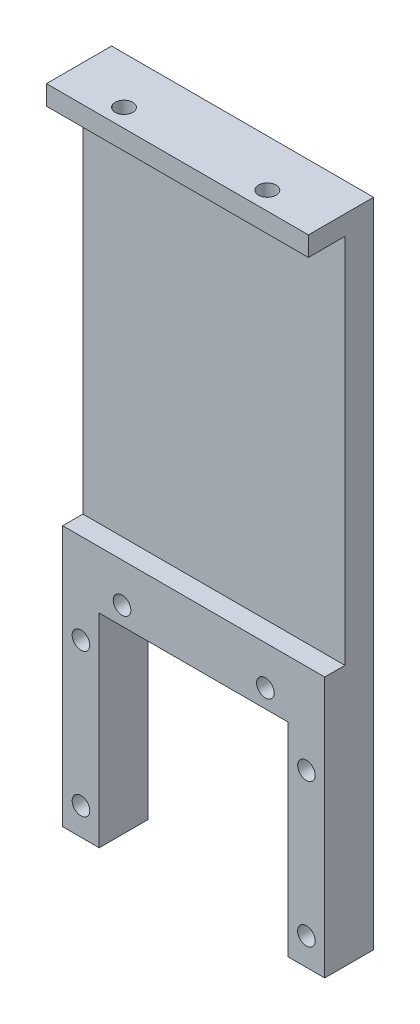
ISO-10303-21;
HEADER;
FILE_DESCRIPTION(('STEP AP214'),'2;1');
FILE_NAME('part.step','',(''),(''),'','','');
FILE_SCHEMA(('AUTOMOTIVE_DESIGN { 1 0 10303 214 1 1 1 1 }'));
ENDSEC;
DATA;
#1=APPLICATION_CONTEXT('core data for automotive mechanical design processes');
#2=APPLICATION_PROTOCOL_DEFINITION('international standard','automotive_design',2000,#1);
#3=PRODUCT_CONTEXT('',#1,'mechanical');
#4=PRODUCT('Part','Part','',(#3));
#5=PRODUCT_RELATED_PRODUCT_CATEGORY('part','',(#4));
#6=PRODUCT_DEFINITION_FORMATION('','',#4);
#7=PRODUCT_DEFINITION_CONTEXT('part definition',#1,'design');
#8=PRODUCT_DEFINITION('design','',#6,#7);
#9=PRODUCT_DEFINITION_SHAPE('','',#8);
#10=(LENGTH_UNIT() NAMED_UNIT(*) SI_UNIT(.MILLI.,.METRE.));
#11=(NAMED_UNIT(*) PLANE_ANGLE_UNIT() SI_UNIT($,.RADIAN.));
#12=(NAMED_UNIT(*) SI_UNIT($,.STERADIAN.) SOLID_ANGLE_UNIT());
#13=UNCERTAINTY_MEASURE_WITH_UNIT(LENGTH_MEASURE(1.E-05),#10,'distance_accuracy_value','');
#14=(GEOMETRIC_REPRESENTATION_CONTEXT(3) GLOBAL_UNCERTAINTY_ASSIGNED_CONTEXT((#13)) GLOBAL_UNIT_ASSIGNED_CONTEXT((#10,
#11,#12)) REPRESENTATION_CONTEXT('',''));
#15=CARTESIAN_POINT('',(0.,0.,0.));
#16=DIRECTION('',(0.,0.,1.));
#17=DIRECTION('',(1.,0.,0.));
#18=AXIS2_PLACEMENT_3D('',#15,#16,#17);
#19=CARTESIAN_POINT('',(-20.1,-50.,10.));
#20=DIRECTION('',(0.,1.,0.));
#21=DIRECTION('',(0.,0.,1.));
#22=AXIS2_PLACEMENT_3D('',#19,#20,#21);
#23=PLANE('',#22);
#24=DIRECTION('',(1.,0.,0.));
#25=VECTOR('',#24,1.);
#26=CARTESIAN_POINT('',(-20.1,-50.,7.5));
#27=LINE('',#26,#25);
#28=CARTESIAN_POINT('',(14.5,-50.,7.5));
#29=VERTEX_POINT('',#28);
#30=CARTESIAN_POINT('',(20.1,-50.,7.5));
#31=VERTEX_POINT('',#30);
#32=EDGE_CURVE('E187',#29,#31,#27,.T.);
#33=ORIENTED_EDGE('',*,*,#32,.F.);
#34=DIRECTION('',(0.,0.,1.));
#35=VECTOR('',#34,1.);
#36=CARTESIAN_POINT('',(14.5,-50.,0.));
#37=LINE('',#36,#35);
#38=CARTESIAN_POINT('',(14.5,-50.,0.));
#39=VERTEX_POINT('',#38);
#40=EDGE_CURVE('E154',#39,#29,#37,.T.);
#41=ORIENTED_EDGE('',*,*,#40,.F.);
#42=DIRECTION('',(1.,0.,0.));
#43=VECTOR('',#42,1.);
#44=CARTESIAN_POINT('',(-20.1,-50.,0.));
#45=LINE('',#44,#43);
#46=CARTESIAN_POINT('',(20.1,-50.,0.));
#47=VERTEX_POINT('',#46);
#48=EDGE_CURVE('E144',#39,#47,#45,.T.);
#49=ORIENTED_EDGE('',*,*,#48,.T.);
#50=DIRECTION('',(0.,0.,-1.));
#51=VECTOR('',#50,1.);
#52=CARTESIAN_POINT('',(20.1,-50.,10.));
#53=LINE('',#52,#51);
#54=EDGE_CURVE('E200',#31,#47,#53,.T.);
#55=ORIENTED_EDGE('',*,*,#54,.F.);
#56=EDGE_LOOP('',(#33,#41,#49,#55));
#57=FACE_BOUND('',#56,.T.);
#58=ADVANCED_FACE('F35',(#57),#23,.F.);
#59=CARTESIAN_POINT('',(20.1,-50.,10.));
#60=DIRECTION('',(-1.,0.,0.));
#61=DIRECTION('',(0.,0.,1.));
#62=AXIS2_PLACEMENT_3D('',#59,#60,#61);
#63=PLANE('',#62);
#64=DIRECTION('',(0.,1.,0.));
#65=VECTOR('',#64,1.);
#66=CARTESIAN_POINT('',(20.1,47.,4.4));
#67=LINE('',#66,#65);
#68=CARTESIAN_POINT('',(20.1,-10.,4.4));
#69=VERTEX_POINT('',#68);
#70=CARTESIAN_POINT('',(20.1,47.,4.4));
#71=VERTEX_POINT('',#70);
#72=EDGE_CURVE('E161',#69,#71,#67,.T.);
#73=ORIENTED_EDGE('',*,*,#72,.F.);
#74=DIRECTION('',(0.,0.,1.));
#75=VECTOR('',#74,1.);
#76=CARTESIAN_POINT('',(20.1,-10.,4.4));
#77=LINE('',#76,#75);
#78=CARTESIAN_POINT('',(20.1,-10.,7.5));
#79=VERTEX_POINT('',#78);
#80=EDGE_CURVE('E174',#69,#79,#77,.T.);
#81=ORIENTED_EDGE('',*,*,#80,.T.);
#82=DIRECTION('',(0.,1.,0.));
#83=VECTOR('',#82,1.);
#84=CARTESIAN_POINT('',(20.1,-50.,7.5));
#85=LINE('',#84,#83);
#86=EDGE_CURVE('E177',#31,#79,#85,.T.);
#87=ORIENTED_EDGE('',*,*,#86,.F.);
#88=ORIENTED_EDGE('',*,*,#54,.T.);
#89=DIRECTION('',(0.,1.,0.));
#90=VECTOR('',#89,1.);
#91=CARTESIAN_POINT('',(20.1,-50.,0.));
#92=LINE('',#91,#90);
#93=CARTESIAN_POINT('',(20.1,50.,0.));
#94=VERTEX_POINT('',#93);
#95=EDGE_CURVE('E191',#47,#94,#92,.T.);
#96=ORIENTED_EDGE('',*,*,#95,.T.);
#97=DIRECTION('',(0.,0.,-1.));
#98=VECTOR('',#97,1.);
#99=CARTESIAN_POINT('',(20.1,50.,10.));
#100=LINE('',#99,#98);
#101=CARTESIAN_POINT('',(20.1,50.,10.));
#102=VERTEX_POINT('',#101);
#103=EDGE_CURVE('E217',#102,#94,#100,.T.);
#104=ORIENTED_EDGE('',*,*,#103,.F.);
#105=DIRECTION('',(0.,1.,0.));
#106=VECTOR('',#105,1.);
#107=CARTESIAN_POINT('',(20.1,-50.,10.));
#108=LINE('',#107,#106);
#109=CARTESIAN_POINT('',(20.1,47.,10.));
#110=VERTEX_POINT('',#109);
#111=EDGE_CURVE('E192',#110,#102,#108,.T.);
#112=ORIENTED_EDGE('',*,*,#111,.F.);
#113=DIRECTION('',(0.,0.,1.));
#114=VECTOR('',#113,1.);
#115=CARTESIAN_POINT('',(20.1,47.,4.4));
#116=LINE('',#115,#114);
#117=EDGE_CURVE('E172',#71,#110,#116,.T.);
#118=ORIENTED_EDGE('',*,*,#117,.F.);
#119=EDGE_LOOP('',(#73,#81,#87,#88,#96,#104,#112,#118));
#120=FACE_BOUND('',#119,.T.);
#121=ADVANCED_FACE('F37',(#120),#63,.F.);
#122=CARTESIAN_POINT('',(-20.1,50.,10.));
#123=DIRECTION('',(0.,-1.,0.));
#124=DIRECTION('',(0.,0.,-1.));
#125=AXIS2_PLACEMENT_3D('',#122,#123,#124);
#126=PLANE('',#125);
#127=CARTESIAN_POINT('',(-11.,50.,7.2));
#128=DIRECTION('',(0.,1.,0.));
#129=DIRECTION('',(0.,0.,1.));
#130=AXIS2_PLACEMENT_3D('',#127,#128,#129);
#131=CIRCLE('',#130,1.35);
#132=CARTESIAN_POINT('',(-11.,50.,8.55));
#133=VERTEX_POINT('',#132);
#134=EDGE_CURVE('E330',#133,#133,#131,.T.);
#135=ORIENTED_EDGE('',*,*,#134,.F.);
#136=EDGE_LOOP('',(#135));
#137=FACE_BOUND('',#136,.T.);
#138=CARTESIAN_POINT('',(11.,50.,7.2));
#139=DIRECTION('',(0.,1.,0.));
#140=DIRECTION('',(0.,0.,1.));
#141=AXIS2_PLACEMENT_3D('',#138,#139,#140);
#142=CIRCLE('',#141,1.35);
#143=CARTESIAN_POINT('',(11.,50.,8.55));
#144=VERTEX_POINT('',#143);
#145=EDGE_CURVE('E333',#144,#144,#142,.T.);
#146=ORIENTED_EDGE('',*,*,#145,.F.);
#147=EDGE_LOOP('',(#146));
#148=FACE_BOUND('',#147,.T.);
#149=DIRECTION('',(-1.,0.,0.));
#150=VECTOR('',#149,1.);
#151=CARTESIAN_POINT('',(-20.1,50.,0.));
#152=LINE('',#151,#150);
#153=CARTESIAN_POINT('',(-20.1,50.,0.));
#154=VERTEX_POINT('',#153);
#155=EDGE_CURVE('E203',#94,#154,#152,.T.);
#156=ORIENTED_EDGE('',*,*,#155,.T.);
#157=DIRECTION('',(0.,0.,-1.));
#158=VECTOR('',#157,1.);
#159=CARTESIAN_POINT('',(-20.1,50.,10.));
#160=LINE('',#159,#158);
#161=CARTESIAN_POINT('',(-20.1,50.,10.));
#162=VERTEX_POINT('',#161);
#163=EDGE_CURVE('E214',#162,#154,#160,.T.);
#164=ORIENTED_EDGE('',*,*,#163,.F.);
#165=DIRECTION('',(-1.,0.,0.));
#166=VECTOR('',#165,1.);
#167=CARTESIAN_POINT('',(-20.1,50.,10.));
#168=LINE('',#167,#166);
#169=EDGE_CURVE('E194',#102,#162,#168,.T.);
#170=ORIENTED_EDGE('',*,*,#169,.F.);
#171=ORIENTED_EDGE('',*,*,#103,.T.);
#172=EDGE_LOOP('',(#156,#164,#170,#171));
#173=FACE_BOUND('',#172,.T.);
#174=ADVANCED_FACE('F292',(#137,#148,#173),#126,.F.);
#175=CARTESIAN_POINT('',(-20.1,-50.,10.));
#176=DIRECTION('',(1.,0.,0.));
#177=DIRECTION('',(0.,0.,-1.));
#178=AXIS2_PLACEMENT_3D('',#175,#176,#177);
#179=PLANE('',#178);
#180=DIRECTION('',(0.,-1.,0.));
#181=VECTOR('',#180,1.);
#182=CARTESIAN_POINT('',(-20.1,-50.,7.5));
#183=LINE('',#182,#181);
#184=CARTESIAN_POINT('',(-20.1,-10.,7.5));
#185=VERTEX_POINT('',#184);
#186=CARTESIAN_POINT('',(-20.1,-50.,7.5));
#187=VERTEX_POINT('',#186);
#188=EDGE_CURVE('E185',#185,#187,#183,.T.);
#189=ORIENTED_EDGE('',*,*,#188,.F.);
#190=DIRECTION('',(0.,0.,1.));
#191=VECTOR('',#190,1.);
#192=CARTESIAN_POINT('',(-20.1,-10.,4.4));
#193=LINE('',#192,#191);
#194=CARTESIAN_POINT('',(-20.1,-10.,4.4));
#195=VERTEX_POINT('',#194);
#196=EDGE_CURVE('E60',#195,#185,#193,.T.);
#197=ORIENTED_EDGE('',*,*,#196,.F.);
#198=DIRECTION('',(0.,-1.,0.));
#199=VECTOR('',#198,1.);
#200=CARTESIAN_POINT('',(-20.1,47.,4.4));
#201=LINE('',#200,#199);
#202=CARTESIAN_POINT('',(-20.1,47.,4.4));
#203=VERTEX_POINT('',#202);
#204=EDGE_CURVE('E167',#203,#195,#201,.T.);
#205=ORIENTED_EDGE('',*,*,#204,.F.);
#206=DIRECTION('',(0.,0.,1.));
#207=VECTOR('',#206,1.);
#208=CARTESIAN_POINT('',(-20.1,47.,4.4));
#209=LINE('',#208,#207);
#210=CARTESIAN_POINT('',(-20.1,47.,10.));
#211=VERTEX_POINT('',#210);
#212=EDGE_CURVE('E179',#203,#211,#209,.T.);
#213=ORIENTED_EDGE('',*,*,#212,.T.);
#214=DIRECTION('',(0.,-1.,0.));
#215=VECTOR('',#214,1.);
#216=CARTESIAN_POINT('',(-20.1,-50.,10.));
#217=LINE('',#216,#215);
#218=EDGE_CURVE('E197',#162,#211,#217,.T.);
#219=ORIENTED_EDGE('',*,*,#218,.F.);
#220=ORIENTED_EDGE('',*,*,#163,.T.);
#221=DIRECTION('',(0.,-1.,0.));
#222=VECTOR('',#221,1.);
#223=CARTESIAN_POINT('',(-20.1,-50.,0.));
#224=LINE('',#223,#222);
#225=CARTESIAN_POINT('',(-20.1,-50.,0.));
#226=VERTEX_POINT('',#225);
#227=EDGE_CURVE('E205',#154,#226,#224,.T.);
#228=ORIENTED_EDGE('',*,*,#227,.T.);
#229=DIRECTION('',(0.,0.,-1.));
#230=VECTOR('',#229,1.);
#231=CARTESIAN_POINT('',(-20.1,-50.,10.));
#232=LINE('',#231,#230);
#233=EDGE_CURVE('E212',#187,#226,#232,.T.);
#234=ORIENTED_EDGE('',*,*,#233,.F.);
#235=EDGE_LOOP('',(#189,#197,#205,#213,#219,#220,#228,#234));
#236=FACE_BOUND('',#235,.T.);
#237=ADVANCED_FACE('F286',(#236),#179,.F.);
#238=CARTESIAN_POINT('',(-14.5,-50.,0.));
#239=VERTEX_POINT('',#238);
#240=EDGE_CURVE('E195',#226,#239,#45,.T.);
#241=ORIENTED_EDGE('',*,*,#240,.T.);
#242=DIRECTION('',(0.,0.,1.));
#243=VECTOR('',#242,1.);
#244=CARTESIAN_POINT('',(-14.5,-50.,0.));
#245=LINE('',#244,#243);
#246=CARTESIAN_POINT('',(-14.5,-50.,7.5));
#247=VERTEX_POINT('',#246);
#248=EDGE_CURVE('E157',#239,#247,#245,.T.);
#249=ORIENTED_EDGE('',*,*,#248,.T.);
#250=EDGE_CURVE('E188',#187,#247,#27,.T.);
#251=ORIENTED_EDGE('',*,*,#250,.F.);
#252=ORIENTED_EDGE('',*,*,#233,.T.);
#253=EDGE_LOOP('',(#241,#249,#251,#252));
#254=FACE_BOUND('',#253,.T.);
#255=ADVANCED_FACE('F281',(#254),#23,.F.);
#256=CARTESIAN_POINT('',(20.1,50.,10.));
#257=DIRECTION('',(0.,0.,-1.));
#258=DIRECTION('',(-1.,0.,0.));
#259=AXIS2_PLACEMENT_3D('',#256,#257,#258);
#260=PLANE('',#259);
#261=ORIENTED_EDGE('',*,*,#218,.T.);
#262=DIRECTION('',(-1.,0.,0.));
#263=VECTOR('',#262,1.);
#264=CARTESIAN_POINT('',(-20.1,47.,10.));
#265=LINE('',#264,#263);
#266=EDGE_CURVE('E156',#110,#211,#265,.T.);
#267=ORIENTED_EDGE('',*,*,#266,.F.);
#268=ORIENTED_EDGE('',*,*,#111,.T.);
#269=ORIENTED_EDGE('',*,*,#169,.T.);
#270=EDGE_LOOP('',(#261,#267,#268,#269));
#271=FACE_BOUND('',#270,.T.);
#272=ADVANCED_FACE('F307',(#271),#260,.F.);
#273=CARTESIAN_POINT('',(20.1,50.,0.));
#274=DIRECTION('',(0.,0.,-1.));
#275=DIRECTION('',(-1.,0.,0.));
#276=AXIS2_PLACEMENT_3D('',#273,#274,#275);
#277=PLANE('',#276);
#278=CARTESIAN_POINT('',(17.3,-45.8,0.));
#279=DIRECTION('',(0.,0.,1.));
#280=DIRECTION('',(1.,0.,0.));
#281=AXIS2_PLACEMENT_3D('',#278,#279,#280);
#282=CIRCLE('',#281,1.35);
#283=CARTESIAN_POINT('',(18.65,-45.8,0.));
#284=VERTEX_POINT('',#283);
#285=EDGE_CURVE('E249',#284,#284,#282,.T.);
#286=ORIENTED_EDGE('',*,*,#285,.T.);
#287=EDGE_LOOP('',(#286));
#288=FACE_BOUND('',#287,.T.);
#289=CARTESIAN_POINT('',(-17.3,-45.8,0.));
#290=DIRECTION('',(0.,0.,1.));
#291=DIRECTION('',(1.,0.,0.));
#292=AXIS2_PLACEMENT_3D('',#289,#290,#291);
#293=CIRCLE('',#292,1.35);
#294=CARTESIAN_POINT('',(-15.95,-45.8,0.));
#295=VERTEX_POINT('',#294);
#296=EDGE_CURVE('E239',#295,#295,#293,.T.);
#297=ORIENTED_EDGE('',*,*,#296,.T.);
#298=EDGE_LOOP('',(#297));
#299=FACE_BOUND('',#298,.T.);
#300=CARTESIAN_POINT('',(-11.,-16.,0.));
#301=DIRECTION('',(0.,0.,1.));
#302=DIRECTION('',(1.,0.,0.));
#303=AXIS2_PLACEMENT_3D('',#300,#301,#302);
#304=CIRCLE('',#303,1.35);
#305=CARTESIAN_POINT('',(-9.65,-16.,0.));
#306=VERTEX_POINT('',#305);
#307=EDGE_CURVE('E236',#306,#306,#304,.T.);
#308=ORIENTED_EDGE('',*,*,#307,.T.);
#309=EDGE_LOOP('',(#308));
#310=FACE_BOUND('',#309,.T.);
#311=CARTESIAN_POINT('',(-17.3,-23.8,0.));
#312=DIRECTION('',(0.,0.,1.));
#313=DIRECTION('',(1.,0.,0.));
#314=AXIS2_PLACEMENT_3D('',#311,#312,#313);
#315=CIRCLE('',#314,1.35000000000001);
#316=CARTESIAN_POINT('',(-15.95,-23.8,0.));
#317=VERTEX_POINT('',#316);
#318=EDGE_CURVE('E233',#317,#317,#315,.T.);
#319=ORIENTED_EDGE('',*,*,#318,.T.);
#320=EDGE_LOOP('',(#319));
#321=FACE_BOUND('',#320,.T.);
#322=CARTESIAN_POINT('',(11.,-16.,0.));
#323=DIRECTION('',(0.,0.,1.));
#324=DIRECTION('',(1.,0.,0.));
#325=AXIS2_PLACEMENT_3D('',#322,#323,#324);
#326=CIRCLE('',#325,1.35);
#327=CARTESIAN_POINT('',(12.35,-16.,0.));
#328=VERTEX_POINT('',#327);
#329=EDGE_CURVE('E229',#328,#328,#326,.T.);
#330=ORIENTED_EDGE('',*,*,#329,.T.);
#331=EDGE_LOOP('',(#330));
#332=FACE_BOUND('',#331,.T.);
#333=CARTESIAN_POINT('',(17.3,-23.8,0.));
#334=DIRECTION('',(0.,0.,1.));
#335=DIRECTION('',(1.,0.,0.));
#336=AXIS2_PLACEMENT_3D('',#333,#334,#335);
#337=CIRCLE('',#336,1.35000000000001);
#338=CARTESIAN_POINT('',(18.65,-23.8,0.));
#339=VERTEX_POINT('',#338);
#340=EDGE_CURVE('E148',#339,#339,#337,.T.);
#341=ORIENTED_EDGE('',*,*,#340,.T.);
#342=EDGE_LOOP('',(#341));
#343=FACE_BOUND('',#342,.T.);
#344=DIRECTION('',(0.,1.,0.));
#345=VECTOR('',#344,1.);
#346=CARTESIAN_POINT('',(14.5,-18.8,0.));
#347=LINE('',#346,#345);
#348=CARTESIAN_POINT('',(14.5,-18.8,0.));
#349=VERTEX_POINT('',#348);
#350=EDGE_CURVE('E127',#39,#349,#347,.T.);
#351=ORIENTED_EDGE('',*,*,#350,.T.);
#352=DIRECTION('',(-1.,0.,0.));
#353=VECTOR('',#352,1.);
#354=CARTESIAN_POINT('',(-14.5,-18.8,0.));
#355=LINE('',#354,#353);
#356=CARTESIAN_POINT('',(-14.5,-18.8,0.));
#357=VERTEX_POINT('',#356);
#358=EDGE_CURVE('E134',#349,#357,#355,.T.);
#359=ORIENTED_EDGE('',*,*,#358,.T.);
#360=DIRECTION('',(0.,-1.,0.));
#361=VECTOR('',#360,1.);
#362=CARTESIAN_POINT('',(-14.5,-18.8,0.));
#363=LINE('',#362,#361);
#364=EDGE_CURVE('E131',#357,#239,#363,.T.);
#365=ORIENTED_EDGE('',*,*,#364,.T.);
#366=ORIENTED_EDGE('',*,*,#240,.F.);
#367=ORIENTED_EDGE('',*,*,#227,.F.);
#368=ORIENTED_EDGE('',*,*,#155,.F.);
#369=ORIENTED_EDGE('',*,*,#95,.F.);
#370=ORIENTED_EDGE('',*,*,#48,.F.);
#371=EDGE_LOOP('',(#351,#359,#365,#366,#367,#368,#369,#370));
#372=FACE_BOUND('',#371,.T.);
#373=ADVANCED_FACE('F142',(#288,#299,#310,#321,#332,#343,#372),#277,.T.);
#374=CARTESIAN_POINT('',(20.1,46.8,7.5));
#375=DIRECTION('',(0.,0.,-1.));
#376=DIRECTION('',(-1.,0.,0.));
#377=AXIS2_PLACEMENT_3D('',#374,#375,#376);
#378=PLANE('',#377);
#379=CARTESIAN_POINT('',(17.3,-45.8,7.5));
#380=DIRECTION('',(0.,0.,-1.));
#381=DIRECTION('',(-1.,0.,0.));
#382=AXIS2_PLACEMENT_3D('',#379,#380,#381);
#383=CIRCLE('',#382,1.35);
#384=CARTESIAN_POINT('',(15.95,-45.8,7.5));
#385=VERTEX_POINT('',#384);
#386=EDGE_CURVE('E39',#385,#385,#383,.T.);
#387=ORIENTED_EDGE('',*,*,#386,.T.);
#388=EDGE_LOOP('',(#387));
#389=FACE_BOUND('',#388,.T.);
#390=CARTESIAN_POINT('',(-17.3,-45.8,7.5));
#391=DIRECTION('',(0.,0.,-1.));
#392=DIRECTION('',(-1.,0.,0.));
#393=AXIS2_PLACEMENT_3D('',#390,#391,#392);
#394=CIRCLE('',#393,1.35);
#395=CARTESIAN_POINT('',(-18.65,-45.8,7.5));
#396=VERTEX_POINT('',#395);
#397=EDGE_CURVE('E237',#396,#396,#394,.T.);
#398=ORIENTED_EDGE('',*,*,#397,.T.);
#399=EDGE_LOOP('',(#398));
#400=FACE_BOUND('',#399,.T.);
#401=CARTESIAN_POINT('',(-11.,-16.,7.5));
#402=DIRECTION('',(0.,0.,-1.));
#403=DIRECTION('',(-1.,0.,0.));
#404=AXIS2_PLACEMENT_3D('',#401,#402,#403);
#405=CIRCLE('',#404,1.35);
#406=CARTESIAN_POINT('',(-12.35,-16.,7.5));
#407=VERTEX_POINT('',#406);
#408=EDGE_CURVE('E234',#407,#407,#405,.T.);
#409=ORIENTED_EDGE('',*,*,#408,.T.);
#410=EDGE_LOOP('',(#409));
#411=FACE_BOUND('',#410,.T.);
#412=CARTESIAN_POINT('',(-17.3,-23.8,7.5));
#413=DIRECTION('',(0.,0.,-1.));
#414=DIRECTION('',(-1.,0.,0.));
#415=AXIS2_PLACEMENT_3D('',#412,#413,#414);
#416=CIRCLE('',#415,1.35000000000001);
#417=CARTESIAN_POINT('',(-18.65,-23.8,7.5));
#418=VERTEX_POINT('',#417);
#419=EDGE_CURVE('E230',#418,#418,#416,.T.);
#420=ORIENTED_EDGE('',*,*,#419,.T.);
#421=EDGE_LOOP('',(#420));
#422=FACE_BOUND('',#421,.T.);
#423=CARTESIAN_POINT('',(11.,-16.,7.5));
#424=DIRECTION('',(0.,0.,-1.));
#425=DIRECTION('',(-1.,0.,0.));
#426=AXIS2_PLACEMENT_3D('',#423,#424,#425);
#427=CIRCLE('',#426,1.35);
#428=CARTESIAN_POINT('',(9.65,-16.,7.5));
#429=VERTEX_POINT('',#428);
#430=EDGE_CURVE('E226',#429,#429,#427,.T.);
#431=ORIENTED_EDGE('',*,*,#430,.T.);
#432=EDGE_LOOP('',(#431));
#433=FACE_BOUND('',#432,.T.);
#434=CARTESIAN_POINT('',(17.3,-23.8,7.5));
#435=DIRECTION('',(0.,0.,-1.));
#436=DIRECTION('',(-1.,0.,0.));
#437=AXIS2_PLACEMENT_3D('',#434,#435,#436);
#438=CIRCLE('',#437,1.35000000000001);
#439=CARTESIAN_POINT('',(15.95,-23.8,7.5));
#440=VERTEX_POINT('',#439);
#441=EDGE_CURVE('E145',#440,#440,#438,.T.);
#442=ORIENTED_EDGE('',*,*,#441,.T.);
#443=EDGE_LOOP('',(#442));
#444=FACE_BOUND('',#443,.T.);
#445=DIRECTION('',(1.,0.,0.));
#446=VECTOR('',#445,1.);
#447=CARTESIAN_POINT('',(20.1,-18.8,7.5));
#448=LINE('',#447,#446);
#449=CARTESIAN_POINT('',(-14.5,-18.8,7.5));
#450=VERTEX_POINT('',#449);
#451=CARTESIAN_POINT('',(14.5,-18.8,7.5));
#452=VERTEX_POINT('',#451);
#453=EDGE_CURVE('E222',#450,#452,#448,.T.);
#454=ORIENTED_EDGE('',*,*,#453,.T.);
#455=DIRECTION('',(0.,-1.,0.));
#456=VECTOR('',#455,1.);
#457=CARTESIAN_POINT('',(14.5,46.8,7.5));
#458=LINE('',#457,#456);
#459=EDGE_CURVE('E12',#452,#29,#458,.T.);
#460=ORIENTED_EDGE('',*,*,#459,.T.);
#461=ORIENTED_EDGE('',*,*,#32,.T.);
#462=ORIENTED_EDGE('',*,*,#86,.T.);
#463=DIRECTION('',(-1.,0.,0.));
#464=VECTOR('',#463,1.);
#465=CARTESIAN_POINT('',(20.1,-10.,7.5));
#466=LINE('',#465,#464);
#467=EDGE_CURVE('E220',#79,#185,#466,.T.);
#468=ORIENTED_EDGE('',*,*,#467,.T.);
#469=ORIENTED_EDGE('',*,*,#188,.T.);
#470=ORIENTED_EDGE('',*,*,#250,.T.);
#471=DIRECTION('',(0.,1.,0.));
#472=VECTOR('',#471,1.);
#473=CARTESIAN_POINT('',(-14.5,46.8,7.5));
#474=LINE('',#473,#472);
#475=EDGE_CURVE('E44',#247,#450,#474,.T.);
#476=ORIENTED_EDGE('',*,*,#475,.T.);
#477=EDGE_LOOP('',(#454,#460,#461,#462,#468,#469,#470,#476));
#478=FACE_BOUND('',#477,.T.);
#479=ADVANCED_FACE('F267',(#389,#400,#411,#422,#433,#444,#478),#378,.F.);
#480=CARTESIAN_POINT('',(-20.1,-10.,4.4));
#481=DIRECTION('',(0.,-1.,0.));
#482=DIRECTION('',(0.,0.,-1.));
#483=AXIS2_PLACEMENT_3D('',#480,#481,#482);
#484=PLANE('',#483);
#485=ORIENTED_EDGE('',*,*,#80,.F.);
#486=DIRECTION('',(1.,0.,0.));
#487=VECTOR('',#486,1.);
#488=CARTESIAN_POINT('',(-20.1,-10.,4.4));
#489=LINE('',#488,#487);
#490=EDGE_CURVE('E169',#195,#69,#489,.T.);
#491=ORIENTED_EDGE('',*,*,#490,.F.);
#492=ORIENTED_EDGE('',*,*,#196,.T.);
#493=ORIENTED_EDGE('',*,*,#467,.F.);
#494=EDGE_LOOP('',(#485,#491,#492,#493));
#495=FACE_BOUND('',#494,.T.);
#496=ADVANCED_FACE('F270',(#495),#484,.F.);
#497=CARTESIAN_POINT('',(-20.1,47.,4.4));
#498=DIRECTION('',(0.,1.,0.));
#499=DIRECTION('',(0.,0.,1.));
#500=AXIS2_PLACEMENT_3D('',#497,#498,#499);
#501=PLANE('',#500);
#502=CARTESIAN_POINT('',(-11.,47.,7.2));
#503=DIRECTION('',(0.,1.,0.));
#504=DIRECTION('',(0.,0.,1.));
#505=AXIS2_PLACEMENT_3D('',#502,#503,#504);
#506=CIRCLE('',#505,1.35);
#507=CARTESIAN_POINT('',(-11.,47.,8.55));
#508=VERTEX_POINT('',#507);
#509=EDGE_CURVE('E336',#508,#508,#506,.F.);
#510=ORIENTED_EDGE('',*,*,#509,.F.);
#511=EDGE_LOOP('',(#510));
#512=FACE_BOUND('',#511,.T.);
#513=CARTESIAN_POINT('',(11.,47.,7.2));
#514=DIRECTION('',(0.,1.,0.));
#515=DIRECTION('',(0.,0.,1.));
#516=AXIS2_PLACEMENT_3D('',#513,#514,#515);
#517=CIRCLE('',#516,1.35);
#518=CARTESIAN_POINT('',(11.,47.,8.55));
#519=VERTEX_POINT('',#518);
#520=EDGE_CURVE('E335',#519,#519,#517,.F.);
#521=ORIENTED_EDGE('',*,*,#520,.F.);
#522=EDGE_LOOP('',(#521));
#523=FACE_BOUND('',#522,.T.);
#524=ORIENTED_EDGE('',*,*,#266,.T.);
#525=ORIENTED_EDGE('',*,*,#212,.F.);
#526=DIRECTION('',(-1.,0.,0.));
#527=VECTOR('',#526,1.);
#528=CARTESIAN_POINT('',(-20.1,47.,4.4));
#529=LINE('',#528,#527);
#530=EDGE_CURVE('E164',#71,#203,#529,.T.);
#531=ORIENTED_EDGE('',*,*,#530,.F.);
#532=ORIENTED_EDGE('',*,*,#117,.T.);
#533=EDGE_LOOP('',(#524,#525,#531,#532));
#534=FACE_BOUND('',#533,.T.);
#535=ADVANCED_FACE('F305',(#512,#523,#534),#501,.F.);
#536=CARTESIAN_POINT('',(20.1,-10.,4.4));
#537=DIRECTION('',(0.,0.,1.));
#538=DIRECTION('',(1.,0.,0.));
#539=AXIS2_PLACEMENT_3D('',#536,#537,#538);
#540=PLANE('',#539);
#541=ORIENTED_EDGE('',*,*,#72,.T.);
#542=ORIENTED_EDGE('',*,*,#530,.T.);
#543=ORIENTED_EDGE('',*,*,#204,.T.);
#544=ORIENTED_EDGE('',*,*,#490,.T.);
#545=EDGE_LOOP('',(#541,#542,#543,#544));
#546=FACE_BOUND('',#545,.T.);
#547=ADVANCED_FACE('F301',(#546),#540,.T.);
#548=CARTESIAN_POINT('',(14.5,-18.8,0.));
#549=DIRECTION('',(1.,0.,0.));
#550=DIRECTION('',(0.,1.,0.));
#551=AXIS2_PLACEMENT_3D('',#548,#549,#550);
#552=PLANE('',#551);
#553=DIRECTION('',(0.,0.,1.));
#554=VECTOR('',#553,1.);
#555=CARTESIAN_POINT('',(14.5,-18.8,0.));
#556=LINE('',#555,#554);
#557=EDGE_CURVE('E52',#349,#452,#556,.T.);
#558=ORIENTED_EDGE('',*,*,#557,.F.);
#559=ORIENTED_EDGE('',*,*,#350,.F.);
#560=ORIENTED_EDGE('',*,*,#40,.T.);
#561=ORIENTED_EDGE('',*,*,#459,.F.);
#562=EDGE_LOOP('',(#558,#559,#560,#561));
#563=FACE_BOUND('',#562,.T.);
#564=ADVANCED_FACE('F125',(#563),#552,.F.);
#565=CARTESIAN_POINT('',(-14.5,-18.8,0.));
#566=DIRECTION('',(-1.,0.,0.));
#567=DIRECTION('',(0.,-1.,0.));
#568=AXIS2_PLACEMENT_3D('',#565,#566,#567);
#569=PLANE('',#568);
#570=ORIENTED_EDGE('',*,*,#248,.F.);
#571=ORIENTED_EDGE('',*,*,#364,.F.);
#572=DIRECTION('',(0.,0.,1.));
#573=VECTOR('',#572,1.);
#574=CARTESIAN_POINT('',(-14.5,-18.8,0.));
#575=LINE('',#574,#573);
#576=EDGE_CURVE('E130',#357,#450,#575,.T.);
#577=ORIENTED_EDGE('',*,*,#576,.T.);
#578=ORIENTED_EDGE('',*,*,#475,.F.);
#579=EDGE_LOOP('',(#570,#571,#577,#578));
#580=FACE_BOUND('',#579,.T.);
#581=ADVANCED_FACE('F277',(#580),#569,.F.);
#582=CARTESIAN_POINT('',(-14.5,-18.8,0.));
#583=DIRECTION('',(0.,1.,0.));
#584=DIRECTION('',(-1.,0.,0.));
#585=AXIS2_PLACEMENT_3D('',#582,#583,#584);
#586=PLANE('',#585);
#587=ORIENTED_EDGE('',*,*,#576,.F.);
#588=ORIENTED_EDGE('',*,*,#358,.F.);
#589=ORIENTED_EDGE('',*,*,#557,.T.);
#590=ORIENTED_EDGE('',*,*,#453,.F.);
#591=EDGE_LOOP('',(#587,#588,#589,#590));
#592=FACE_BOUND('',#591,.T.);
#593=ADVANCED_FACE('F135',(#592),#586,.F.);
#594=CARTESIAN_POINT('',(17.3,-23.8,0.));
#595=DIRECTION('',(0.,0.,1.));
#596=DIRECTION('',(1.,0.,0.));
#597=AXIS2_PLACEMENT_3D('',#594,#595,#596);
#598=CYLINDRICAL_SURFACE('',#597,1.35000000000001);
#599=ORIENTED_EDGE('',*,*,#340,.F.);
#600=EDGE_LOOP('',(#599));
#601=FACE_BOUND('',#600,.T.);
#602=ORIENTED_EDGE('',*,*,#441,.F.);
#603=EDGE_LOOP('',(#602));
#604=FACE_BOUND('',#603,.T.);
#605=ADVANCED_FACE('F263',(#601,#604),#598,.F.);
#606=CARTESIAN_POINT('',(11.,-16.,0.));
#607=DIRECTION('',(0.,0.,1.));
#608=DIRECTION('',(1.,0.,0.));
#609=AXIS2_PLACEMENT_3D('',#606,#607,#608);
#610=CYLINDRICAL_SURFACE('',#609,1.35);
#611=ORIENTED_EDGE('',*,*,#329,.F.);
#612=EDGE_LOOP('',(#611));
#613=FACE_BOUND('',#612,.T.);
#614=ORIENTED_EDGE('',*,*,#430,.F.);
#615=EDGE_LOOP('',(#614));
#616=FACE_BOUND('',#615,.T.);
#617=ADVANCED_FACE('F259',(#613,#616),#610,.F.);
#618=CARTESIAN_POINT('',(-17.3,-23.8,0.));
#619=DIRECTION('',(0.,0.,1.));
#620=DIRECTION('',(1.,0.,0.));
#621=AXIS2_PLACEMENT_3D('',#618,#619,#620);
#622=CYLINDRICAL_SURFACE('',#621,1.35000000000001);
#623=ORIENTED_EDGE('',*,*,#318,.F.);
#624=EDGE_LOOP('',(#623));
#625=FACE_BOUND('',#624,.T.);
#626=ORIENTED_EDGE('',*,*,#419,.F.);
#627=EDGE_LOOP('',(#626));
#628=FACE_BOUND('',#627,.T.);
#629=ADVANCED_FACE('F262',(#625,#628),#622,.F.);
#630=CARTESIAN_POINT('',(-11.,-16.,0.));
#631=DIRECTION('',(0.,0.,1.));
#632=DIRECTION('',(1.,0.,0.));
#633=AXIS2_PLACEMENT_3D('',#630,#631,#632);
#634=CYLINDRICAL_SURFACE('',#633,1.35);
#635=ORIENTED_EDGE('',*,*,#307,.F.);
#636=EDGE_LOOP('',(#635));
#637=FACE_BOUND('',#636,.T.);
#638=ORIENTED_EDGE('',*,*,#408,.F.);
#639=EDGE_LOOP('',(#638));
#640=FACE_BOUND('',#639,.T.);
#641=ADVANCED_FACE('F367',(#637,#640),#634,.F.);
#642=CARTESIAN_POINT('',(-17.3,-45.8,0.));
#643=DIRECTION('',(0.,0.,1.));
#644=DIRECTION('',(1.,0.,0.));
#645=AXIS2_PLACEMENT_3D('',#642,#643,#644);
#646=CYLINDRICAL_SURFACE('',#645,1.35);
#647=ORIENTED_EDGE('',*,*,#296,.F.);
#648=EDGE_LOOP('',(#647));
#649=FACE_BOUND('',#648,.T.);
#650=ORIENTED_EDGE('',*,*,#397,.F.);
#651=EDGE_LOOP('',(#650));
#652=FACE_BOUND('',#651,.T.);
#653=ADVANCED_FACE('F361',(#649,#652),#646,.F.);
#654=CARTESIAN_POINT('',(17.3,-45.8,0.));
#655=DIRECTION('',(0.,0.,1.));
#656=DIRECTION('',(1.,0.,0.));
#657=AXIS2_PLACEMENT_3D('',#654,#655,#656);
#658=CYLINDRICAL_SURFACE('',#657,1.35);
#659=ORIENTED_EDGE('',*,*,#285,.F.);
#660=EDGE_LOOP('',(#659));
#661=FACE_BOUND('',#660,.T.);
#662=ORIENTED_EDGE('',*,*,#386,.F.);
#663=EDGE_LOOP('',(#662));
#664=FACE_BOUND('',#663,.T.);
#665=ADVANCED_FACE('F356',(#661,#664),#658,.F.);
#666=CARTESIAN_POINT('',(11.,-50.001,7.2));
#667=DIRECTION('',(0.,1.,0.));
#668=DIRECTION('',(0.,0.,1.));
#669=AXIS2_PLACEMENT_3D('',#666,#667,#668);
#670=CYLINDRICAL_SURFACE('',#669,1.35);
#671=ORIENTED_EDGE('',*,*,#145,.T.);
#672=EDGE_LOOP('',(#671));
#673=FACE_BOUND('',#672,.T.);
#674=ORIENTED_EDGE('',*,*,#520,.T.);
#675=EDGE_LOOP('',(#674));
#676=FACE_BOUND('',#675,.T.);
#677=ADVANCED_FACE('F346',(#673,#676),#670,.F.);
#678=CARTESIAN_POINT('',(-11.,-50.001,7.2));
#679=DIRECTION('',(0.,1.,0.));
#680=DIRECTION('',(0.,0.,1.));
#681=AXIS2_PLACEMENT_3D('',#678,#679,#680);
#682=CYLINDRICAL_SURFACE('',#681,1.35);
#683=ORIENTED_EDGE('',*,*,#134,.T.);
#684=EDGE_LOOP('',(#683));
#685=FACE_BOUND('',#684,.T.);
#686=ORIENTED_EDGE('',*,*,#509,.T.);
#687=EDGE_LOOP('',(#686));
#688=FACE_BOUND('',#687,.T.);
#689=ADVANCED_FACE('F343',(#685,#688),#682,.F.);
#690=CLOSED_SHELL('',(#58,#121,#174,#237,#255,#272,#373,#479,#496,#535,#547,#564,#581,#593,#605,
#617,#629,#641,#653,#665,#677,#689));
#691=MANIFOLD_SOLID_BREP('B2',#690);
#692=ADVANCED_BREP_SHAPE_REPRESENTATION('',(#18,#691),#14);
#693=SHAPE_DEFINITION_REPRESENTATION(#9,#692);
ENDSEC;
END-ISO-10303-21;
